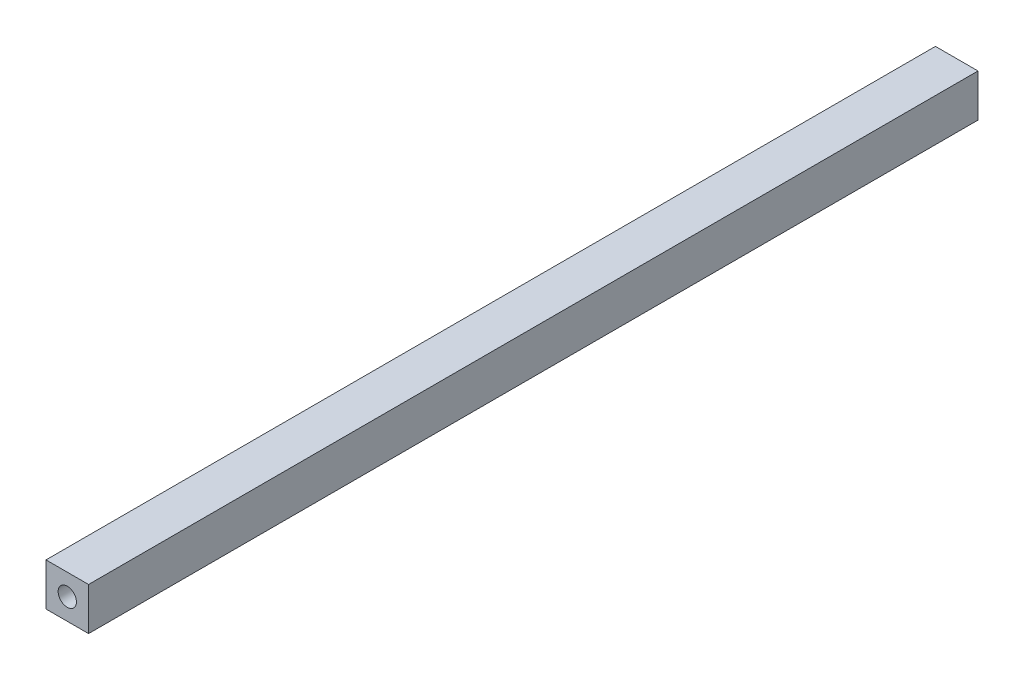
ISO-10303-21;
HEADER;
FILE_DESCRIPTION(('STEP AP214'),'2;1');
FILE_NAME('part.step','',(''),(''),'','','');
FILE_SCHEMA(('AUTOMOTIVE_DESIGN { 1 0 10303 214 1 1 1 1 }'));
ENDSEC;
DATA;
#1=APPLICATION_CONTEXT('core data for automotive mechanical design processes');
#2=APPLICATION_PROTOCOL_DEFINITION('international standard','automotive_design',2000,#1);
#3=PRODUCT_CONTEXT('',#1,'mechanical');
#4=PRODUCT('Part','Part','',(#3));
#5=PRODUCT_RELATED_PRODUCT_CATEGORY('part','',(#4));
#6=PRODUCT_DEFINITION_FORMATION('','',#4);
#7=PRODUCT_DEFINITION_CONTEXT('part definition',#1,'design');
#8=PRODUCT_DEFINITION('design','',#6,#7);
#9=PRODUCT_DEFINITION_SHAPE('','',#8);
#10=(LENGTH_UNIT() NAMED_UNIT(*) SI_UNIT(.MILLI.,.METRE.));
#11=(NAMED_UNIT(*) PLANE_ANGLE_UNIT() SI_UNIT($,.RADIAN.));
#12=(NAMED_UNIT(*) SI_UNIT($,.STERADIAN.) SOLID_ANGLE_UNIT());
#13=UNCERTAINTY_MEASURE_WITH_UNIT(LENGTH_MEASURE(1.E-05),#10,'distance_accuracy_value','');
#14=(GEOMETRIC_REPRESENTATION_CONTEXT(3) GLOBAL_UNCERTAINTY_ASSIGNED_CONTEXT((#13)) GLOBAL_UNIT_ASSIGNED_CONTEXT((#10,
#11,#12)) REPRESENTATION_CONTEXT('',''));
#15=CARTESIAN_POINT('',(0.,0.,0.));
#16=DIRECTION('',(0.,0.,1.));
#17=DIRECTION('',(1.,0.,0.));
#18=AXIS2_PLACEMENT_3D('',#15,#16,#17);
#19=CARTESIAN_POINT('',(14.,-14.,585.));
#20=DIRECTION('',(-1.,0.,0.));
#21=DIRECTION('',(0.,0.,1.));
#22=AXIS2_PLACEMENT_3D('',#19,#20,#21);
#23=PLANE('',#22);
#24=DIRECTION('',(0.,1.,0.));
#25=VECTOR('',#24,1.);
#26=CARTESIAN_POINT('',(14.,-14.,0.));
#27=LINE('',#26,#25);
#28=CARTESIAN_POINT('',(14.,-14.,0.));
#29=VERTEX_POINT('',#28);
#30=CARTESIAN_POINT('',(14.,14.,0.));
#31=VERTEX_POINT('',#30);
#32=EDGE_CURVE('E95',#29,#31,#27,.T.);
#33=ORIENTED_EDGE('',*,*,#32,.T.);
#34=DIRECTION('',(0.,0.,-1.));
#35=VECTOR('',#34,1.);
#36=CARTESIAN_POINT('',(14.,14.,585.));
#37=LINE('',#36,#35);
#38=CARTESIAN_POINT('',(14.,14.,585.));
#39=VERTEX_POINT('',#38);
#40=EDGE_CURVE('E11',#39,#31,#37,.T.);
#41=ORIENTED_EDGE('',*,*,#40,.F.);
#42=DIRECTION('',(0.,1.,0.));
#43=VECTOR('',#42,1.);
#44=CARTESIAN_POINT('',(14.,-14.,585.));
#45=LINE('',#44,#43);
#46=CARTESIAN_POINT('',(14.,-14.,585.));
#47=VERTEX_POINT('',#46);
#48=EDGE_CURVE('E83',#47,#39,#45,.T.);
#49=ORIENTED_EDGE('',*,*,#48,.F.);
#50=DIRECTION('',(0.,0.,-1.));
#51=VECTOR('',#50,1.);
#52=CARTESIAN_POINT('',(14.,-14.,585.));
#53=LINE('',#52,#51);
#54=EDGE_CURVE('E91',#47,#29,#53,.T.);
#55=ORIENTED_EDGE('',*,*,#54,.T.);
#56=EDGE_LOOP('',(#33,#41,#49,#55));
#57=FACE_BOUND('',#56,.T.);
#58=ADVANCED_FACE('F32',(#57),#23,.F.);
#59=CARTESIAN_POINT('',(-14.,14.,585.));
#60=DIRECTION('',(0.,-1.,0.));
#61=DIRECTION('',(0.,0.,-1.));
#62=AXIS2_PLACEMENT_3D('',#59,#60,#61);
#63=PLANE('',#62);
#64=DIRECTION('',(-1.,0.,0.));
#65=VECTOR('',#64,1.);
#66=CARTESIAN_POINT('',(-14.,14.,0.));
#67=LINE('',#66,#65);
#68=CARTESIAN_POINT('',(-14.,14.,0.));
#69=VERTEX_POINT('',#68);
#70=EDGE_CURVE('E87',#31,#69,#67,.T.);
#71=ORIENTED_EDGE('',*,*,#70,.T.);
#72=DIRECTION('',(0.,0.,-1.));
#73=VECTOR('',#72,1.);
#74=CARTESIAN_POINT('',(-14.,14.,585.));
#75=LINE('',#74,#73);
#76=CARTESIAN_POINT('',(-14.,14.,585.));
#77=VERTEX_POINT('',#76);
#78=EDGE_CURVE('E40',#77,#69,#75,.T.);
#79=ORIENTED_EDGE('',*,*,#78,.F.);
#80=DIRECTION('',(-1.,0.,0.));
#81=VECTOR('',#80,1.);
#82=CARTESIAN_POINT('',(-14.,14.,585.));
#83=LINE('',#82,#81);
#84=EDGE_CURVE('E78',#39,#77,#83,.T.);
#85=ORIENTED_EDGE('',*,*,#84,.F.);
#86=ORIENTED_EDGE('',*,*,#40,.T.);
#87=EDGE_LOOP('',(#71,#79,#85,#86));
#88=FACE_BOUND('',#87,.T.);
#89=ADVANCED_FACE('F86',(#88),#63,.F.);
#90=CARTESIAN_POINT('',(-14.,-14.,585.));
#91=DIRECTION('',(1.,0.,0.));
#92=DIRECTION('',(0.,0.,-1.));
#93=AXIS2_PLACEMENT_3D('',#90,#91,#92);
#94=PLANE('',#93);
#95=DIRECTION('',(0.,-1.,0.));
#96=VECTOR('',#95,1.);
#97=CARTESIAN_POINT('',(-14.,-14.,0.));
#98=LINE('',#97,#96);
#99=CARTESIAN_POINT('',(-14.,-14.,0.));
#100=VERTEX_POINT('',#99);
#101=EDGE_CURVE('E65',#69,#100,#98,.T.);
#102=ORIENTED_EDGE('',*,*,#101,.T.);
#103=DIRECTION('',(0.,0.,-1.));
#104=VECTOR('',#103,1.);
#105=CARTESIAN_POINT('',(-14.,-14.,585.));
#106=LINE('',#105,#104);
#107=CARTESIAN_POINT('',(-14.,-14.,585.));
#108=VERTEX_POINT('',#107);
#109=EDGE_CURVE('E88',#108,#100,#106,.T.);
#110=ORIENTED_EDGE('',*,*,#109,.F.);
#111=DIRECTION('',(0.,-1.,0.));
#112=VECTOR('',#111,1.);
#113=CARTESIAN_POINT('',(-14.,-14.,585.));
#114=LINE('',#113,#112);
#115=EDGE_CURVE('E81',#77,#108,#114,.T.);
#116=ORIENTED_EDGE('',*,*,#115,.F.);
#117=ORIENTED_EDGE('',*,*,#78,.T.);
#118=EDGE_LOOP('',(#102,#110,#116,#117));
#119=FACE_BOUND('',#118,.T.);
#120=ADVANCED_FACE('F89',(#119),#94,.F.);
#121=CARTESIAN_POINT('',(-14.,-14.,585.));
#122=DIRECTION('',(0.,1.,0.));
#123=DIRECTION('',(0.,0.,1.));
#124=AXIS2_PLACEMENT_3D('',#121,#122,#123);
#125=PLANE('',#124);
#126=DIRECTION('',(1.,0.,0.));
#127=VECTOR('',#126,1.);
#128=CARTESIAN_POINT('',(-14.,-14.,0.));
#129=LINE('',#128,#127);
#130=EDGE_CURVE('E71',#100,#29,#129,.T.);
#131=ORIENTED_EDGE('',*,*,#130,.T.);
#132=ORIENTED_EDGE('',*,*,#54,.F.);
#133=DIRECTION('',(1.,0.,0.));
#134=VECTOR('',#133,1.);
#135=CARTESIAN_POINT('',(-14.,-14.,585.));
#136=LINE('',#135,#134);
#137=EDGE_CURVE('E48',#108,#47,#136,.T.);
#138=ORIENTED_EDGE('',*,*,#137,.F.);
#139=ORIENTED_EDGE('',*,*,#109,.T.);
#140=EDGE_LOOP('',(#131,#132,#138,#139));
#141=FACE_BOUND('',#140,.T.);
#142=ADVANCED_FACE('F103',(#141),#125,.F.);
#143=CARTESIAN_POINT('',(0.,0.,585.));
#144=DIRECTION('',(0.,0.,-1.));
#145=DIRECTION('',(-1.,0.,0.));
#146=AXIS2_PLACEMENT_3D('',#143,#144,#145);
#147=PLANE('',#146);
#148=CARTESIAN_POINT('',(0.,0.,585.));
#149=DIRECTION('',(0.,0.,1.));
#150=DIRECTION('',(1.,0.,0.));
#151=AXIS2_PLACEMENT_3D('',#148,#149,#150);
#152=CIRCLE('',#151,6.);
#153=CARTESIAN_POINT('',(6.,0.,585.));
#154=VERTEX_POINT('',#153);
#155=EDGE_CURVE('E109',#154,#154,#152,.T.);
#156=ORIENTED_EDGE('',*,*,#155,.F.);
#157=EDGE_LOOP('',(#156));
#158=FACE_BOUND('',#157,.T.);
#159=ORIENTED_EDGE('',*,*,#48,.T.);
#160=ORIENTED_EDGE('',*,*,#84,.T.);
#161=ORIENTED_EDGE('',*,*,#115,.T.);
#162=ORIENTED_EDGE('',*,*,#137,.T.);
#163=EDGE_LOOP('',(#159,#160,#161,#162));
#164=FACE_BOUND('',#163,.T.);
#165=ADVANCED_FACE('F79',(#158,#164),#147,.F.);
#166=CARTESIAN_POINT('',(0.,0.,0.));
#167=DIRECTION('',(0.,0.,-1.));
#168=DIRECTION('',(-1.,0.,0.));
#169=AXIS2_PLACEMENT_3D('',#166,#167,#168);
#170=PLANE('',#169);
#171=ORIENTED_EDGE('',*,*,#32,.F.);
#172=ORIENTED_EDGE('',*,*,#130,.F.);
#173=ORIENTED_EDGE('',*,*,#101,.F.);
#174=ORIENTED_EDGE('',*,*,#70,.F.);
#175=EDGE_LOOP('',(#171,#172,#173,#174));
#176=FACE_BOUND('',#175,.T.);
#177=ADVANCED_FACE('F106',(#176),#170,.T.);
#178=CARTESIAN_POINT('',(0.,0.,525.));
#179=DIRECTION('',(0.,0.,1.));
#180=DIRECTION('',(1.,0.,0.));
#181=AXIS2_PLACEMENT_3D('',#178,#179,#180);
#182=CYLINDRICAL_SURFACE('',#181,6.);
#183=CARTESIAN_POINT('',(0.,0.,525.));
#184=DIRECTION('',(0.,0.,1.));
#185=DIRECTION('',(1.,0.,0.));
#186=AXIS2_PLACEMENT_3D('',#183,#184,#185);
#187=CIRCLE('',#186,6.);
#188=CARTESIAN_POINT('',(6.,0.,525.));
#189=VERTEX_POINT('',#188);
#190=EDGE_CURVE('E98',#189,#189,#187,.T.);
#191=ORIENTED_EDGE('',*,*,#190,.F.);
#192=EDGE_LOOP('',(#191));
#193=FACE_BOUND('',#192,.T.);
#194=ORIENTED_EDGE('',*,*,#155,.T.);
#195=EDGE_LOOP('',(#194));
#196=FACE_BOUND('',#195,.T.);
#197=ADVANCED_FACE('F117',(#193,#196),#182,.F.);
#198=CARTESIAN_POINT('',(0.,0.,525.));
#199=DIRECTION('',(0.,0.,1.));
#200=DIRECTION('',(1.,0.,0.));
#201=AXIS2_PLACEMENT_3D('',#198,#199,#200);
#202=PLANE('',#201);
#203=ORIENTED_EDGE('',*,*,#190,.T.);
#204=EDGE_LOOP('',(#203));
#205=FACE_BOUND('',#204,.T.);
#206=ADVANCED_FACE('F115',(#205),#202,.T.);
#207=CLOSED_SHELL('',(#58,#89,#120,#142,#165,#177,#197,#206));
#208=MANIFOLD_SOLID_BREP('B2',#207);
#209=ADVANCED_BREP_SHAPE_REPRESENTATION('',(#18,#208),#14);
#210=SHAPE_DEFINITION_REPRESENTATION(#9,#209);
ENDSEC;
END-ISO-10303-21;
